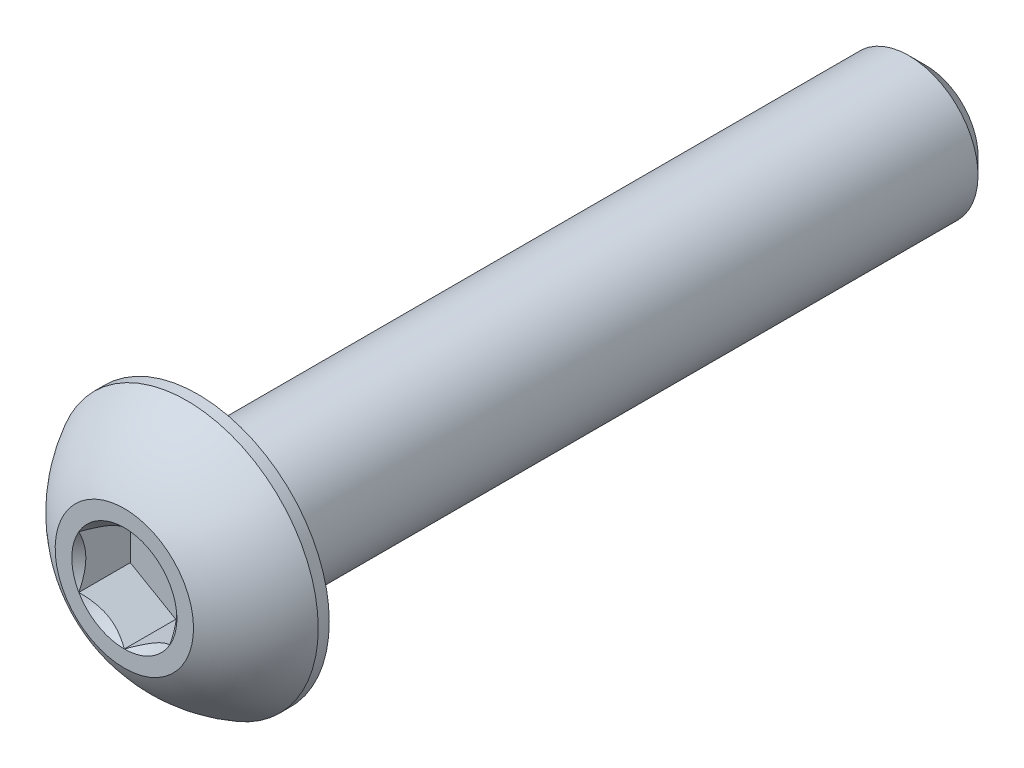
ISO-10303-21;
HEADER;
FILE_DESCRIPTION(('STEP AP214'),'2;1');
FILE_NAME('part.step','',(''),(''),'','','');
FILE_SCHEMA(('AUTOMOTIVE_DESIGN { 1 0 10303 214 1 1 1 1 }'));
ENDSEC;
DATA;
#1=APPLICATION_CONTEXT('core data for automotive mechanical design processes');
#2=APPLICATION_PROTOCOL_DEFINITION('international standard','automotive_design',2000,#1);
#3=PRODUCT_CONTEXT('',#1,'mechanical');
#4=PRODUCT('Part','Part','',(#3));
#5=PRODUCT_RELATED_PRODUCT_CATEGORY('part','',(#4));
#6=PRODUCT_DEFINITION_FORMATION('','',#4);
#7=PRODUCT_DEFINITION_CONTEXT('part definition',#1,'design');
#8=PRODUCT_DEFINITION('design','',#6,#7);
#9=PRODUCT_DEFINITION_SHAPE('','',#8);
#10=(LENGTH_UNIT() NAMED_UNIT(*) SI_UNIT(.MILLI.,.METRE.));
#11=(NAMED_UNIT(*) PLANE_ANGLE_UNIT() SI_UNIT($,.RADIAN.));
#12=(NAMED_UNIT(*) SI_UNIT($,.STERADIAN.) SOLID_ANGLE_UNIT());
#13=UNCERTAINTY_MEASURE_WITH_UNIT(LENGTH_MEASURE(1.E-05),#10,'distance_accuracy_value','');
#14=(GEOMETRIC_REPRESENTATION_CONTEXT(3) GLOBAL_UNCERTAINTY_ASSIGNED_CONTEXT((#13)) GLOBAL_UNIT_ASSIGNED_CONTEXT((#10,
#11,#12)) REPRESENTATION_CONTEXT('',''));
#15=CARTESIAN_POINT('',(0.,0.,0.));
#16=DIRECTION('',(0.,0.,1.));
#17=DIRECTION('',(1.,0.,0.));
#18=AXIS2_PLACEMENT_3D('',#15,#16,#17);
#19=CARTESIAN_POINT('',(0.,-2.413,-27.9654));
#20=DIRECTION('',(0.,0.,-1.));
#21=DIRECTION('',(0.,1.,0.));
#22=AXIS2_PLACEMENT_3D('',#19,#20,#21);
#23=PLANE('',#22);
#24=CARTESIAN_POINT('',(0.,0.,-27.9654));
#25=DIRECTION('',(0.,0.,-1.));
#26=DIRECTION('',(0.,1.,0.));
#27=AXIS2_PLACEMENT_3D('',#24,#25,#26);
#28=CIRCLE('',#27,1.81768750000001);
#29=CARTESIAN_POINT('',(0.,1.8176875,-27.9654));
#30=VERTEX_POINT('',#29);
#31=EDGE_CURVE('E42',#30,#30,#28,.T.);
#32=ORIENTED_EDGE('',*,*,#31,.T.);
#33=EDGE_LOOP('',(#32));
#34=FACE_BOUND('',#33,.T.);
#35=ADVANCED_FACE('F34',(#34),#23,.T.);
#36=CARTESIAN_POINT('',(0.,0.,-27.9654));
#37=DIRECTION('',(0.,0.,-1.));
#38=DIRECTION('',(0.,1.,0.));
#39=AXIS2_PLACEMENT_3D('',#36,#37,#38);
#40=CYLINDRICAL_SURFACE('',#39,2.413);
#41=CARTESIAN_POINT('',(0.,0.,-27.3700875));
#42=DIRECTION('',(0.,0.,-1.));
#43=DIRECTION('',(0.,1.,0.));
#44=AXIS2_PLACEMENT_3D('',#41,#42,#43);
#45=CIRCLE('',#44,2.413);
#46=CARTESIAN_POINT('',(0.,2.413,-27.3700875));
#47=VERTEX_POINT('',#46);
#48=EDGE_CURVE('E11',#47,#47,#45,.F.);
#49=ORIENTED_EDGE('',*,*,#48,.T.);
#50=EDGE_LOOP('',(#49));
#51=FACE_BOUND('',#50,.T.);
#52=CARTESIAN_POINT('',(0.,0.,-2.5654));
#53=DIRECTION('',(0.,0.,1.));
#54=DIRECTION('',(1.,0.,0.));
#55=AXIS2_PLACEMENT_3D('',#52,#53,#54);
#56=CIRCLE('',#55,2.413);
#57=CARTESIAN_POINT('',(2.413,0.,-2.5654));
#58=VERTEX_POINT('',#57);
#59=EDGE_CURVE('E168',#58,#58,#56,.F.);
#60=ORIENTED_EDGE('',*,*,#59,.T.);
#61=EDGE_LOOP('',(#60));
#62=FACE_BOUND('',#61,.T.);
#63=ADVANCED_FACE('F176',(#51,#62),#40,.T.);
#64=CARTESIAN_POINT('',(0.,0.,-27.9654));
#65=DIRECTION('',(0.,0.,1.));
#66=DIRECTION('',(0.,-1.,0.));
#67=AXIS2_PLACEMENT_3D('',#64,#65,#66);
#68=CONICAL_SURFACE('',#67,1.81768750000001,0.785398163397447);
#69=ORIENTED_EDGE('',*,*,#48,.F.);
#70=EDGE_LOOP('',(#69));
#71=FACE_BOUND('',#70,.T.);
#72=ORIENTED_EDGE('',*,*,#31,.F.);
#73=EDGE_LOOP('',(#72));
#74=FACE_BOUND('',#73,.T.);
#75=ADVANCED_FACE('F36',(#71,#74),#68,.T.);
#76=CARTESIAN_POINT('',(0.,0.,-4.5748806144438));
#77=DIRECTION('',(0.,0.,1.));
#78=DIRECTION('',(0.,-1.,0.));
#79=AXIS2_PLACEMENT_3D('',#76,#77,#78);
#80=SPHERICAL_SURFACE('',#79,5.17224338526463);
#81=CARTESIAN_POINT('',(0.,0.,0.));
#82=DIRECTION('',(0.,0.,1.));
#83=DIRECTION('',(1.,0.,0.));
#84=AXIS2_PLACEMENT_3D('',#81,#82,#83);
#85=CIRCLE('',#84,2.413);
#86=CARTESIAN_POINT('',(0.,-2.413,0.));
#87=VERTEX_POINT('',#86);
#88=EDGE_CURVE('E165',#87,#87,#85,.T.);
#89=CARTESIAN_POINT('',(0.,0.,-2.18059));
#90=DIRECTION('',(0.,0.,1.));
#91=DIRECTION('',(1.,0.,0.));
#92=AXIS2_PLACEMENT_3D('',#89,#90,#91);
#93=CIRCLE('',#92,4.5847);
#94=CARTESIAN_POINT('',(0.,-4.5847,-2.18059));
#95=VERTEX_POINT('',#94);
#96=EDGE_CURVE('E159',#95,#95,#93,.T.);
#97=CARTESIAN_POINT('',(0.,-2.413,0.));
#98=CARTESIAN_POINT('',(0.,-2.44179113663083,-0.0151857097788009));
#99=CARTESIAN_POINT('',(0.,-2.47043888331474,-0.0306432741933343));
#100=CARTESIAN_POINT('',(0.,-2.5274374690351,-0.0620964513369402));
#101=CARTESIAN_POINT('',(0.,-2.55578830807155,-0.0780920640660127));
#102=CARTESIAN_POINT('',(0.,-2.61218295074331,-0.110615676881771));
#103=CARTESIAN_POINT('',(0.,-2.64022675437863,-0.127143676968457));
#104=CARTESIAN_POINT('',(0.,-2.69599733629138,-0.160726162390165));
#105=CARTESIAN_POINT('',(0.,-2.72372411456882,-0.177780647725188));
#106=CARTESIAN_POINT('',(0.,-2.77885076121154,-0.21241002764294));
#107=CARTESIAN_POINT('',(0.,-2.80625062957682,-0.229984922225668));
#108=CARTESIAN_POINT('',(0.,-2.86071369040082,-0.265648855453746));
#109=CARTESIAN_POINT('',(0.,-2.88777688285954,-0.283737894099096));
#110=CARTESIAN_POINT('',(0.,-2.94155694533546,-0.320423667994127));
#111=CARTESIAN_POINT('',(0.,-2.96827381535265,-0.339020403243808));
#112=CARTESIAN_POINT('',(0.,-3.02135171000009,-0.37671494166065));
#113=CARTESIAN_POINT('',(0.,-3.04771273463033,-0.39581274482781));
#114=CARTESIAN_POINT('',(0.,-3.10006954235699,-0.434502611862808));
#115=CARTESIAN_POINT('',(0.,-3.12606532545341,-0.454094675730644));
#116=CARTESIAN_POINT('',(0.,-3.17768238416296,-0.493766080756604));
#117=CARTESIAN_POINT('',(0.,-3.20330365977609,-0.513845421914727));
#118=CARTESIAN_POINT('',(0.,-3.25416257105645,-0.554484224430573));
#119=CARTESIAN_POINT('',(0.,-3.27940020672367,-0.575043685788297));
#120=CARTESIAN_POINT('',(0.,-3.32948284239517,-0.616635400476975));
#121=CARTESIAN_POINT('',(0.,-3.35432784239946,-0.63766765380793));
#122=CARTESIAN_POINT('',(0.,-3.40361635097913,-0.680197455694829));
#123=CARTESIAN_POINT('',(0.,-3.42805985955453,-0.701695004250773));
#124=CARTESIAN_POINT('',(0.,-3.47653667261836,-0.745147733989217));
#125=CARTESIAN_POINT('',(0.,-3.5005699771068,-0.767102915171716));
#126=CARTESIAN_POINT('',(0.,-3.54821781555203,-0.81146308444603));
#127=CARTESIAN_POINT('',(0.,-3.57183234950881,-0.833868072537843));
#128=CARTESIAN_POINT('',(0.,-3.61863422971284,-0.879119869584105));
#129=CARTESIAN_POINT('',(0.,-3.64182157596008,-0.901966678538555));
#130=CARTESIAN_POINT('',(0.,-3.68776081583415,-0.948093973780533));
#131=CARTESIAN_POINT('',(0.,-3.71051270946098,-0.971374460068061));
#132=CARTESIAN_POINT('',(0.,-3.75557293439636,-1.01836081186645));
#133=CARTESIAN_POINT('',(0.,-3.7778812657049,-1.0420666773773));
#134=CARTESIAN_POINT('',(0.,-3.82204641440941,-1.08989533789018));
#135=CARTESIAN_POINT('',(0.,-3.84390323180538,-1.11401813289221));
#136=CARTESIAN_POINT('',(0.,-3.88715756202836,-1.16267205404467));
#137=CARTESIAN_POINT('',(0.,-3.90855507485536,-1.18720318019511));
#138=CARTESIAN_POINT('',(0.,-3.95088316899876,-1.23666501975588));
#139=CARTESIAN_POINT('',(0.,-3.97181375031515,-1.26159573316622));
#140=CARTESIAN_POINT('',(0.,-4.01320052092912,-1.31184786092909));
#141=CARTESIAN_POINT('',(0.,-4.03365671022669,-1.33716927528163));
#142=CARTESIAN_POINT('',(0.,-4.07408740538699,-1.38819377934977));
#143=CARTESIAN_POINT('',(0.,-4.09406191124973,-1.41389686906536));
#144=CARTESIAN_POINT('',(0.,-4.13352211981722,-1.46567556223513));
#145=CARTESIAN_POINT('',(0.,-4.15300782252198,-1.4917511656893));
#146=CARTESIAN_POINT('',(0.,-4.19148347927457,-1.54426559193551));
#147=CARTESIAN_POINT('',(0.,-4.2104734333224,-1.57070441472756));
#148=CARTESIAN_POINT('',(0.,-4.24795082398615,-1.6239358557723));
#149=CARTESIAN_POINT('',(0.,-4.26643826060207,-1.65072847402499));
#150=CARTESIAN_POINT('',(0.,-4.3029040266735,-1.70465795604563));
#151=CARTESIAN_POINT('',(0.,-4.32088235612901,-1.73179481981358));
#152=CARTESIAN_POINT('',(0.,-4.35632349988304,-1.78640312007115));
#153=CARTESIAN_POINT('',(0.,-4.37378631418156,-1.81387455656079));
#154=CARTESIAN_POINT('',(0.,-4.40819020238474,-1.86914221075438));
#155=CARTESIAN_POINT('',(0.,-4.42513127628939,-1.89693842845834));
#156=CARTESIAN_POINT('',(0.,-4.45848564813517,-1.95284573578717));
#157=CARTESIAN_POINT('',(0.,-4.4748989460763,-1.98095682541204));
#158=CARTESIAN_POINT('',(0.,-4.50719190474587,-2.03748386259807));
#159=CARTESIAN_POINT('',(0.,-4.5230715654743,-2.06589981015923));
#160=CARTESIAN_POINT('',(0.,-4.55429163018258,-2.12302641242262));
#161=CARTESIAN_POINT('',(0.,-4.56963203416241,-2.15173706712485));
#162=CARTESIAN_POINT('',(0.,-4.5847,-2.18059));
#163=B_SPLINE_CURVE_WITH_KNOTS('',3,(#97,#98,#99,#100,#101,#102,#103,#104,#105,#106,#107,#108,
#109,#110,#111,#112,#113,#114,#115,#116,#117,#118,#119,#120,#121,#122,#123,#124,#125,#126,#127,
#128,#129,#130,#131,#132,#133,#134,#135,#136,#137,#138,#139,#140,#141,#142,#143,#144,#145,#146,
#147,#148,#149,#150,#151,#152,#153,#154,#155,#156,#157,#158,#159,#160,#161,#162),.UNSPECIFIED.,
.F.,.F.,(4,2,2,2,2,2,2,2,2,2,2,2,2,2,2,2,2,2,2,2,2,2,2,2,2,2,2,2,2,2,2,2,4),(0.,
0.0976500604051489,0.195300120810298,0.292950181215447,0.390600241620598,0.488250302025747,
0.585900362430896,0.683550422836046,0.781200483241194,0.878850543646344,0.976500604051493,
1.07415066445664,1.17180072486179,1.26945078526694,1.36710084567209,1.46475090607724,
1.56240096648239,1.66005102688754,1.75770108729269,1.85535114769784,1.95300120810299,
2.05065126850814,2.14830132891329,2.24595138931843,2.34360144972358,2.44125151012873,
2.53890157053388,2.63655163093903,2.73420169134418,2.83185175174933,2.92950181215448,
3.02715187255963,3.12480193296478),.UNSPECIFIED.);
#164=EDGE_CURVE('BSEAM175',#87,#95,#163,.T.);
#165=ORIENTED_EDGE('',*,*,#88,.F.);
#166=ORIENTED_EDGE('',*,*,#96,.T.);
#167=ORIENTED_EDGE('',*,*,#164,.T.);
#168=ORIENTED_EDGE('',*,*,#164,.F.);
#169=EDGE_LOOP('',(#165,#167,#166,#168));
#170=FACE_BOUND('',#169,.T.);
#171=ADVANCED_FACE('F175',(#170),#80,.T.);
#172=CARTESIAN_POINT('',(0.,-2.413,0.));
#173=DIRECTION('',(0.,0.,-1.));
#174=DIRECTION('',(-1.,0.,0.));
#175=AXIS2_PLACEMENT_3D('',#172,#173,#174);
#176=PLANE('',#175);
#177=CARTESIAN_POINT('',(0.,0.,0.));
#178=DIRECTION('',(0.,0.,1.));
#179=DIRECTION('',(1.,0.,0.));
#180=AXIS2_PLACEMENT_3D('',#177,#178,#179);
#181=CIRCLE('',#180,1.83308710467706);
#182=CARTESIAN_POINT('',(-1.5875,0.91654355233853,0.));
#183=VERTEX_POINT('',#182);
#184=CARTESIAN_POINT('',(-1.5875,-0.916543552338531,0.));
#185=VERTEX_POINT('',#184);
#186=EDGE_CURVE('E55',#183,#185,#181,.T.);
#187=ORIENTED_EDGE('',*,*,#186,.F.);
#188=CARTESIAN_POINT('',(0.,1.83308710467706,0.));
#189=VERTEX_POINT('',#188);
#190=EDGE_CURVE('E129',#189,#183,#181,.T.);
#191=ORIENTED_EDGE('',*,*,#190,.F.);
#192=CARTESIAN_POINT('',(1.5875,0.916543552338531,0.));
#193=VERTEX_POINT('',#192);
#194=EDGE_CURVE('E106',#193,#189,#181,.T.);
#195=ORIENTED_EDGE('',*,*,#194,.F.);
#196=CARTESIAN_POINT('',(1.5875,-0.916543552338531,0.));
#197=VERTEX_POINT('',#196);
#198=EDGE_CURVE('E95',#197,#193,#181,.T.);
#199=ORIENTED_EDGE('',*,*,#198,.F.);
#200=CARTESIAN_POINT('',(0.,-1.83308710467706,0.));
#201=VERTEX_POINT('',#200);
#202=EDGE_CURVE('E87',#201,#197,#181,.T.);
#203=ORIENTED_EDGE('',*,*,#202,.F.);
#204=EDGE_CURVE('E48',#185,#201,#181,.T.);
#205=ORIENTED_EDGE('',*,*,#204,.F.);
#206=EDGE_LOOP('',(#187,#191,#195,#199,#203,#205));
#207=FACE_BOUND('',#206,.T.);
#208=ORIENTED_EDGE('',*,*,#88,.T.);
#209=EDGE_LOOP('',(#208));
#210=FACE_BOUND('',#209,.T.);
#211=ADVANCED_FACE('F126',(#207,#210),#176,.F.);
#212=CARTESIAN_POINT('',(0.,-4.5847,-2.5654));
#213=DIRECTION('',(0.,0.,1.));
#214=DIRECTION('',(1.,0.,0.));
#215=AXIS2_PLACEMENT_3D('',#212,#213,#214);
#216=PLANE('',#215);
#217=ORIENTED_EDGE('',*,*,#59,.F.);
#218=EDGE_LOOP('',(#217));
#219=FACE_BOUND('',#218,.T.);
#220=CARTESIAN_POINT('',(0.,0.,-2.5654));
#221=DIRECTION('',(0.,0.,1.));
#222=DIRECTION('',(1.,0.,0.));
#223=AXIS2_PLACEMENT_3D('',#220,#221,#222);
#224=CIRCLE('',#223,4.5847);
#225=CARTESIAN_POINT('',(4.5847,0.,-2.5654));
#226=VERTEX_POINT('',#225);
#227=EDGE_CURVE('E162',#226,#226,#224,.T.);
#228=ORIENTED_EDGE('',*,*,#227,.F.);
#229=EDGE_LOOP('',(#228));
#230=FACE_BOUND('',#229,.T.);
#231=ADVANCED_FACE('F193',(#219,#230),#216,.F.);
#232=CARTESIAN_POINT('',(0.,0.,0.));
#233=DIRECTION('',(0.,0.,1.));
#234=DIRECTION('',(1.,0.,0.));
#235=AXIS2_PLACEMENT_3D('',#232,#233,#234);
#236=CYLINDRICAL_SURFACE('',#235,4.5847);
#237=ORIENTED_EDGE('',*,*,#96,.F.);
#238=EDGE_LOOP('',(#237));
#239=FACE_BOUND('',#238,.T.);
#240=ORIENTED_EDGE('',*,*,#227,.T.);
#241=EDGE_LOOP('',(#240));
#242=FACE_BOUND('',#241,.T.);
#243=ADVANCED_FACE('F196',(#239,#242),#236,.T.);
#244=CARTESIAN_POINT('',(0.,0.,0.));
#245=DIRECTION('',(0.,0.,1.));
#246=DIRECTION('',(1.,0.,0.));
#247=AXIS2_PLACEMENT_3D('',#244,#245,#246);
#248=CONICAL_SURFACE('',#247,1.83308710467706,0.78539816339745);
#249=ORIENTED_EDGE('',*,*,#198,.T.);
#250=CARTESIAN_POINT('',(1.5875,-1.83163614232865,0.590762562254565));
#251=CARTESIAN_POINT('',(1.5875,-1.78705354844902,0.55707785480324));
#252=CARTESIAN_POINT('',(1.5875,-1.74222294150555,0.523722329968627));
#253=CARTESIAN_POINT('',(1.5875,-1.65196486784504,0.457805675888285));
#254=CARTESIAN_POINT('',(1.5875,-1.60653725449665,0.425244747634468));
#255=CARTESIAN_POINT('',(1.5875,-1.46854281940082,0.328493449461236));
#256=CARTESIAN_POINT('',(1.5875,-1.37494211623386,0.265753264612858));
#257=CARTESIAN_POINT('',(1.5875,-1.17864136265695,0.142553151294645));
#258=CARTESIAN_POINT('',(1.5875,-1.07572731596385,0.0824303289226488));
#259=CARTESIAN_POINT('',(1.5875,-0.864754189558117,-0.0275706334490079));
#260=CARTESIAN_POINT('',(1.5875,-0.756714033301438,-0.0774833149376714));
#261=CARTESIAN_POINT('',(1.5875,-0.594580029688666,-0.138547963751185));
#262=CARTESIAN_POINT('',(1.5875,-0.542894373932897,-0.156067797502568));
#263=CARTESIAN_POINT('',(1.5875,-0.43827206291756,-0.186958420156953));
#264=CARTESIAN_POINT('',(1.5875,-0.3853353220534,-0.200328924255393));
#265=CARTESIAN_POINT('',(1.5875,-0.27941340073437,-0.222002681044568));
#266=CARTESIAN_POINT('',(1.5875,-0.226446313904206,-0.230392976800141));
#267=CARTESIAN_POINT('',(1.5875,-0.119941637592404,-0.241941911012322));
#268=CARTESIAN_POINT('',(1.5875,-0.0664041486263234,-0.245101456366562));
#269=CARTESIAN_POINT('',(1.5875,0.0387581192420279,-0.245952982965122));
#270=CARTESIAN_POINT('',(1.5875,0.090381381554216,-0.243840334608509));
#271=CARTESIAN_POINT('',(1.5875,0.19318730201683,-0.234695846678065));
#272=CARTESIAN_POINT('',(1.5875,0.244369916988517,-0.227663530460197));
#273=CARTESIAN_POINT('',(1.5875,0.346790527788956,-0.208944949355169));
#274=CARTESIAN_POINT('',(1.5875,0.398013804172139,-0.197179358640977));
#275=CARTESIAN_POINT('',(1.5875,0.499340680307276,-0.169620657149212));
#276=CARTESIAN_POINT('',(1.5875,0.549444372105894,-0.153827878801824));
#277=CARTESIAN_POINT('',(1.5875,0.707022639586407,-0.0982133790717417));
#278=CARTESIAN_POINT('',(1.5875,0.812258737570578,-0.0520647672653368));
#279=CARTESIAN_POINT('',(1.5875,1.01778869013701,0.0505458403808823));
#280=CARTESIAN_POINT('',(1.5875,1.11806310933257,0.107044855107553));
#281=CARTESIAN_POINT('',(1.5875,1.30970442577157,0.223612502972616));
#282=CARTESIAN_POINT('',(1.5875,1.40126637149297,0.283364441978613));
#283=CARTESIAN_POINT('',(1.5875,1.53616443073864,0.37573700869171));
#284=CARTESIAN_POINT('',(1.5875,1.58054835823549,0.406854014274728));
#285=CARTESIAN_POINT('',(1.5875,1.66870952512132,0.469911550181166));
#286=CARTESIAN_POINT('',(1.5875,1.71248692801697,0.501851851647461));
#287=CARTESIAN_POINT('',(1.5875,1.75601179240957,0.534133557847131));
#288=B_SPLINE_CURVE_WITH_KNOTS('',3,(#250,#251,#252,#253,#254,#255,#256,#257,#258,#259,#260,
#261,#262,#263,#264,#265,#266,#267,#268,#269,#270,#271,#272,#273,#274,#275,#276,#277,#278,#279,
#280,#281,#282,#283,#284,#285,#286,#287),.UNSPECIFIED.,.F.,.F.,(4,2,2,2,2,2,2,2,2,2,2,2,2,2,2,2,
2,2,4),(0.,0.167627505127548,0.33529698084648,0.673194674702938,1.0304700708717,
1.38651603079307,1.55010049300858,1.71369618096554,1.87434127467533,2.034958513124,
2.18971280484453,2.34448209207484,2.50196108385089,2.65942708049529,3.00314617711216,
3.34811949873714,3.6759579216973,3.83856722085481,4.00113179576279),.UNSPECIFIED.);
#289=EDGE_CURVE('E100',#197,#193,#288,.T.);
#290=ORIENTED_EDGE('',*,*,#289,.F.);
#291=EDGE_LOOP('',(#249,#290));
#292=FACE_BOUND('',#291,.T.);
#293=ADVANCED_FACE('F101',(#292),#248,.F.);
#294=ORIENTED_EDGE('',*,*,#194,.T.);
#295=CARTESIAN_POINT('',(1.5877,0.916428082284693,0.000115480963706964));
#296=CARTESIAN_POINT('',(1.53312479190086,0.947937093371809,-0.0313691916294028));
#297=CARTESIAN_POINT('',(1.47763696320971,0.979973006203395,-0.0610049539864698));
#298=CARTESIAN_POINT('',(1.36449087915364,1.04529792829092,-0.115267739979175));
#299=CARTESIAN_POINT('',(1.30682185887062,1.07859315267522,-0.139864564866823));
#300=CARTESIAN_POINT('',(1.1905349781269,1.14573141457583,-0.181999635727418));
#301=CARTESIAN_POINT('',(1.13194674474407,1.17955734689075,-0.199643807270178));
#302=CARTESIAN_POINT('',(1.01348022674557,1.24795402294714,-0.226828529915031));
#303=CARTESIAN_POINT('',(0.953605562983896,1.28252267618758,-0.236389379304923));
#304=CARTESIAN_POINT('',(0.850418771876558,1.34209759781022,-0.245015586895992));
#305=CARTESIAN_POINT('',(0.807240015952288,1.36702686416637,-0.246292807190424));
#306=CARTESIAN_POINT('',(0.720953038535399,1.41684467380557,-0.244142944185295));
#307=CARTESIAN_POINT('',(0.677844847078612,1.44173319974742,-0.240714211450657));
#308=CARTESIAN_POINT('',(0.592046335002031,1.49126899379091,-0.229349005566657));
#309=CARTESIAN_POINT('',(0.549356408925407,1.51591603410293,-0.221408628198358));
#310=CARTESIAN_POINT('',(0.464693063478359,1.56479643938728,-0.201451585548899));
#311=CARTESIAN_POINT('',(0.422719959755075,1.58902962212064,-0.189433170791309));
#312=CARTESIAN_POINT('',(0.315211458113566,1.65109968448354,-0.153753102752754));
#313=CARTESIAN_POINT('',(0.2503427717089,1.68855163804125,-0.127401427696863));
#314=CARTESIAN_POINT('',(0.154961599380924,1.74361998356043,-0.082916463148298));
#315=CARTESIAN_POINT('',(0.123530699536157,1.76176662204668,-0.0672871421988686));
#316=CARTESIAN_POINT('',(0.0612469855696368,1.79772614107138,-0.0346015121388987));
#317=CARTESIAN_POINT('',(0.0303939039605763,1.8155391760437,-0.0175458843430302));
#318=CARTESIAN_POINT('',(-0.000200000000000412,1.8332025747309,0.000115480963706783));
#319=B_SPLINE_CURVE_WITH_KNOTS('',3,(#295,#296,#297,#298,#299,#300,#301,#302,#303,#304,#305,
#306,#307,#308,#309,#310,#311,#312,#313,#314,#315,#316,#317,#318),.UNSPECIFIED.,.F.,.F.,(4,2,2,
2,2,2,2,2,2,2,2,4),(0.,0.211482650810816,0.424197870807275,0.633533884524815,0.842342653263348,
0.99175555372714,1.14122083674204,1.29081565918877,1.44047473906437,1.6781878086972,
1.79671410024894,1.91518409436631),.UNSPECIFIED.);
#320=EDGE_CURVE('E105',#193,#189,#319,.T.);
#321=ORIENTED_EDGE('',*,*,#320,.F.);
#322=EDGE_LOOP('',(#294,#321));
#323=FACE_BOUND('',#322,.T.);
#324=ADVANCED_FACE('F281',(#323),#248,.F.);
#325=ORIENTED_EDGE('',*,*,#190,.T.);
#326=CARTESIAN_POINT('',(0.000199999999999602,1.8332025747309,0.000115480963706835));
#327=CARTESIAN_POINT('',(-0.0543752080991368,1.80169356364378,-0.031369191629403));
#328=CARTESIAN_POINT('',(-0.10986303679029,1.7696576508122,-0.06100495398647));
#329=CARTESIAN_POINT('',(-0.223009120846359,1.70433272872467,-0.115267739979175));
#330=CARTESIAN_POINT('',(-0.280678141129381,1.67103750434037,-0.139864564866824));
#331=CARTESIAN_POINT('',(-0.396965021873103,1.60389924243976,-0.181999635727418));
#332=CARTESIAN_POINT('',(-0.455553255255931,1.57007331012484,-0.199643807270178));
#333=CARTESIAN_POINT('',(-0.574019773254431,1.50167663406845,-0.226828529915031));
#334=CARTESIAN_POINT('',(-0.633894437016105,1.46710798082801,-0.236389379304923));
#335=CARTESIAN_POINT('',(-0.737081228123443,1.40753305920537,-0.245015586895992));
#336=CARTESIAN_POINT('',(-0.780259984047713,1.38260379284922,-0.246292807190424));
#337=CARTESIAN_POINT('',(-0.866546961464602,1.33278598321002,-0.244142944185295));
#338=CARTESIAN_POINT('',(-0.909655152921388,1.30789745726817,-0.240714211450657));
#339=CARTESIAN_POINT('',(-0.99545366499797,1.25836166322468,-0.229349005566657));
#340=CARTESIAN_POINT('',(-1.03814359107459,1.23371462291266,-0.221408628198358));
#341=CARTESIAN_POINT('',(-1.12280693652164,1.18483421762831,-0.201451585548899));
#342=CARTESIAN_POINT('',(-1.16478004024493,1.16060103489495,-0.189433170791309));
#343=CARTESIAN_POINT('',(-1.27228854188643,1.09853097253205,-0.153753102752754));
#344=CARTESIAN_POINT('',(-1.3371572282911,1.06107901897434,-0.127401427696863));
#345=CARTESIAN_POINT('',(-1.43253840061908,1.00601067345516,-0.082916463148298));
#346=CARTESIAN_POINT('',(-1.46396930046384,0.987864034968913,-0.0672871421988685));
#347=CARTESIAN_POINT('',(-1.52625301443036,0.951904515944214,-0.0346015121388985));
#348=CARTESIAN_POINT('',(-1.55710609603942,0.934091480971893,-0.0175458843430301));
#349=CARTESIAN_POINT('',(-1.5877,0.916428082284692,0.000115480963706555));
#350=B_SPLINE_CURVE_WITH_KNOTS('',3,(#326,#327,#328,#329,#330,#331,#332,#333,#334,#335,#336,
#337,#338,#339,#340,#341,#342,#343,#344,#345,#346,#347,#348,#349),.UNSPECIFIED.,.F.,.F.,(4,2,2,
2,2,2,2,2,2,2,2,4),(0.,0.211482650810816,0.424197870807276,0.633533884524816,0.842342653263348,
0.991755553727141,1.14122083674205,1.29081565918877,1.44047473906438,1.6781878086972,
1.79671410024894,1.91518409436631),.UNSPECIFIED.);
#351=EDGE_CURVE('E136',#189,#183,#350,.T.);
#352=ORIENTED_EDGE('',*,*,#351,.F.);
#353=EDGE_LOOP('',(#325,#352));
#354=FACE_BOUND('',#353,.T.);
#355=ADVANCED_FACE('F134',(#354),#248,.F.);
#356=ORIENTED_EDGE('',*,*,#186,.T.);
#357=CARTESIAN_POINT('',(-1.5875,-1.83163614232865,0.590762562254564));
#358=CARTESIAN_POINT('',(-1.5875,-1.78705354844902,0.557077854803239));
#359=CARTESIAN_POINT('',(-1.5875,-1.74222294150555,0.523722329968626));
#360=CARTESIAN_POINT('',(-1.5875,-1.65196486784504,0.457805675888285));
#361=CARTESIAN_POINT('',(-1.5875,-1.60653725449665,0.425244747634468));
#362=CARTESIAN_POINT('',(-1.5875,-1.46854281940082,0.328493449461235));
#363=CARTESIAN_POINT('',(-1.5875,-1.37494211623386,0.265753264612857));
#364=CARTESIAN_POINT('',(-1.5875,-1.17864136265695,0.142553151294644));
#365=CARTESIAN_POINT('',(-1.5875,-1.07572731596385,0.0824303289226486));
#366=CARTESIAN_POINT('',(-1.5875,-0.864754189558117,-0.0275706334490081));
#367=CARTESIAN_POINT('',(-1.5875,-0.756714033301438,-0.0774833149376718));
#368=CARTESIAN_POINT('',(-1.5875,-0.594580029688666,-0.138547963751185));
#369=CARTESIAN_POINT('',(-1.5875,-0.542894373932898,-0.156067797502568));
#370=CARTESIAN_POINT('',(-1.5875,-0.438272062917561,-0.186958420156953));
#371=CARTESIAN_POINT('',(-1.5875,-0.385335322053401,-0.200328924255393));
#372=CARTESIAN_POINT('',(-1.5875,-0.27941340073437,-0.222002681044568));
#373=CARTESIAN_POINT('',(-1.5875,-0.226446313904207,-0.230392976800141));
#374=CARTESIAN_POINT('',(-1.5875,-0.119941637592405,-0.241941911012322));
#375=CARTESIAN_POINT('',(-1.5875,-0.0664041486263238,-0.245101456366562));
#376=CARTESIAN_POINT('',(-1.5875,0.0387581192420274,-0.245952982965122));
#377=CARTESIAN_POINT('',(-1.5875,0.0903813815542156,-0.243840334608509));
#378=CARTESIAN_POINT('',(-1.5875,0.193187302016829,-0.234695846678065));
#379=CARTESIAN_POINT('',(-1.5875,0.244369916988516,-0.227663530460197));
#380=CARTESIAN_POINT('',(-1.5875,0.346790527788956,-0.208944949355169));
#381=CARTESIAN_POINT('',(-1.5875,0.398013804172139,-0.197179358640977));
#382=CARTESIAN_POINT('',(-1.5875,0.499340680307276,-0.169620657149213));
#383=CARTESIAN_POINT('',(-1.5875,0.549444372105893,-0.153827878801824));
#384=CARTESIAN_POINT('',(-1.5875,0.707022639586407,-0.0982133790717423));
#385=CARTESIAN_POINT('',(-1.5875,0.812258737570577,-0.0520647672653372));
#386=CARTESIAN_POINT('',(-1.5875,1.01778869013701,0.050545840380882));
#387=CARTESIAN_POINT('',(-1.5875,1.11806310933256,0.107044855107552));
#388=CARTESIAN_POINT('',(-1.5875,1.30970442577157,0.223612502972616));
#389=CARTESIAN_POINT('',(-1.5875,1.40126637149297,0.283364441978612));
#390=CARTESIAN_POINT('',(-1.5875,1.53616443073864,0.375737008691709));
#391=CARTESIAN_POINT('',(-1.5875,1.58054835823549,0.406854014274727));
#392=CARTESIAN_POINT('',(-1.5875,1.66870952512132,0.469911550181165));
#393=CARTESIAN_POINT('',(-1.5875,1.71248692801697,0.50185185164746));
#394=CARTESIAN_POINT('',(-1.5875,1.75601179240957,0.53413355784713));
#395=B_SPLINE_CURVE_WITH_KNOTS('',3,(#357,#358,#359,#360,#361,#362,#363,#364,#365,#366,#367,
#368,#369,#370,#371,#372,#373,#374,#375,#376,#377,#378,#379,#380,#381,#382,#383,#384,#385,#386,
#387,#388,#389,#390,#391,#392,#393,#394),.UNSPECIFIED.,.F.,.F.,(4,2,2,2,2,2,2,2,2,2,2,2,2,2,2,2,
2,2,4),(0.,0.167627505127548,0.335296980846479,0.673194674702938,1.0304700708717,
1.38651603079307,1.55010049300858,1.71369618096554,1.87434127467533,2.034958513124,
2.18971280484453,2.34448209207484,2.50196108385089,2.65942708049529,3.00314617711216,
3.34811949873714,3.67595792169729,3.83856722085481,4.00113179576279),.UNSPECIFIED.);
#396=EDGE_CURVE('E140',#183,#185,#395,.F.);
#397=ORIENTED_EDGE('',*,*,#396,.F.);
#398=EDGE_LOOP('',(#356,#397));
#399=FACE_BOUND('',#398,.T.);
#400=ADVANCED_FACE('F275',(#399),#248,.F.);
#401=ORIENTED_EDGE('',*,*,#204,.T.);
#402=CARTESIAN_POINT('',(-1.5877,-0.916428082284693,0.000115480963706531));
#403=CARTESIAN_POINT('',(-1.53312479190086,-0.947937093371809,-0.0313691916294031));
#404=CARTESIAN_POINT('',(-1.47763696320971,-0.979973006203394,-0.06100495398647));
#405=CARTESIAN_POINT('',(-1.36449087915364,-1.04529792829092,-0.115267739979175));
#406=CARTESIAN_POINT('',(-1.30682185887062,-1.07859315267522,-0.139864564866824));
#407=CARTESIAN_POINT('',(-1.1905349781269,-1.14573141457583,-0.181999635727418));
#408=CARTESIAN_POINT('',(-1.13194674474407,-1.17955734689075,-0.199643807270178));
#409=CARTESIAN_POINT('',(-1.01348022674557,-1.24795402294714,-0.226828529915031));
#410=CARTESIAN_POINT('',(-0.953605562983895,-1.28252267618758,-0.236389379304923));
#411=CARTESIAN_POINT('',(-0.850418771876558,-1.34209759781022,-0.245015586895992));
#412=CARTESIAN_POINT('',(-0.807240015952288,-1.36702686416637,-0.246292807190424));
#413=CARTESIAN_POINT('',(-0.720953038535399,-1.41684467380557,-0.244142944185295));
#414=CARTESIAN_POINT('',(-0.677844847078612,-1.44173319974742,-0.240714211450657));
#415=CARTESIAN_POINT('',(-0.592046335002031,-1.49126899379091,-0.229349005566657));
#416=CARTESIAN_POINT('',(-0.549356408925407,-1.51591603410293,-0.221408628198358));
#417=CARTESIAN_POINT('',(-0.464693063478359,-1.56479643938728,-0.201451585548899));
#418=CARTESIAN_POINT('',(-0.422719959755075,-1.58902962212064,-0.189433170791309));
#419=CARTESIAN_POINT('',(-0.315211458113566,-1.65109968448354,-0.153753102752754));
#420=CARTESIAN_POINT('',(-0.2503427717089,-1.68855163804125,-0.127401427696864));
#421=CARTESIAN_POINT('',(-0.154961599380924,-1.74361998356043,-0.082916463148298));
#422=CARTESIAN_POINT('',(-0.123530699536156,-1.76176662204668,-0.0672871421988684));
#423=CARTESIAN_POINT('',(-0.0612469855696366,-1.79772614107138,-0.0346015121388983));
#424=CARTESIAN_POINT('',(-0.030393903960576,-1.8155391760437,-0.0175458843430298));
#425=CARTESIAN_POINT('',(0.000200000000000753,-1.8332025747309,0.000115480963706965));
#426=B_SPLINE_CURVE_WITH_KNOTS('',3,(#402,#403,#404,#405,#406,#407,#408,#409,#410,#411,#412,
#413,#414,#415,#416,#417,#418,#419,#420,#421,#422,#423,#424,#425),.UNSPECIFIED.,.F.,.F.,(4,2,2,
2,2,2,2,2,2,2,2,4),(0.,0.211482650810816,0.424197870807275,0.633533884524815,0.842342653263347,
0.99175555372714,1.14122083674204,1.29081565918877,1.44047473906437,1.6781878086972,
1.79671410024894,1.91518409436631),.UNSPECIFIED.);
#427=EDGE_CURVE('E116',#185,#201,#426,.T.);
#428=ORIENTED_EDGE('',*,*,#427,.F.);
#429=EDGE_LOOP('',(#401,#428));
#430=FACE_BOUND('',#429,.T.);
#431=ADVANCED_FACE('F223',(#430),#248,.F.);
#432=ORIENTED_EDGE('',*,*,#202,.T.);
#433=CARTESIAN_POINT('',(-0.000199999999999123,-1.8332025747309,0.000115480963707269));
#434=CARTESIAN_POINT('',(0.0543752080991372,-1.80169356364378,-0.0313691916294027));
#435=CARTESIAN_POINT('',(0.109863036790291,-1.7696576508122,-0.0610049539864697));
#436=CARTESIAN_POINT('',(0.22300912084636,-1.70433272872467,-0.115267739979174));
#437=CARTESIAN_POINT('',(0.280678141129382,-1.67103750434037,-0.139864564866823));
#438=CARTESIAN_POINT('',(0.396965021873104,-1.60389924243976,-0.181999635727418));
#439=CARTESIAN_POINT('',(0.455553255255932,-1.57007331012484,-0.199643807270178));
#440=CARTESIAN_POINT('',(0.574019773254432,-1.50167663406845,-0.226828529915031));
#441=CARTESIAN_POINT('',(0.633894437016106,-1.46710798082801,-0.236389379304922));
#442=CARTESIAN_POINT('',(0.737081228123443,-1.40753305920537,-0.245015586895992));
#443=CARTESIAN_POINT('',(0.780259984047713,-1.38260379284922,-0.246292807190423));
#444=CARTESIAN_POINT('',(0.866546961464602,-1.33278598321002,-0.244142944185295));
#445=CARTESIAN_POINT('',(0.909655152921389,-1.30789745726817,-0.240714211450656));
#446=CARTESIAN_POINT('',(0.99545366499797,-1.25836166322468,-0.229349005566656));
#447=CARTESIAN_POINT('',(1.03814359107459,-1.23371462291266,-0.221408628198358));
#448=CARTESIAN_POINT('',(1.12280693652164,-1.18483421762831,-0.201451585548898));
#449=CARTESIAN_POINT('',(1.16478004024493,-1.16060103489495,-0.189433170791309));
#450=CARTESIAN_POINT('',(1.27228854188643,-1.09853097253205,-0.153753102752754));
#451=CARTESIAN_POINT('',(1.3371572282911,-1.06107901897434,-0.127401427696863));
#452=CARTESIAN_POINT('',(1.43253840061908,-1.00601067345516,-0.0829164631482976));
#453=CARTESIAN_POINT('',(1.46396930046384,-0.987864034968914,-0.0672871421988682));
#454=CARTESIAN_POINT('',(1.52625301443036,-0.951904515944214,-0.0346015121388983));
#455=CARTESIAN_POINT('',(1.55710609603942,-0.934091480971893,-0.0175458843430299));
#456=CARTESIAN_POINT('',(1.5877,-0.916428082284693,0.000115480963706771));
#457=B_SPLINE_CURVE_WITH_KNOTS('',3,(#433,#434,#435,#436,#437,#438,#439,#440,#441,#442,#443,
#444,#445,#446,#447,#448,#449,#450,#451,#452,#453,#454,#455,#456),.UNSPECIFIED.,.F.,.F.,(4,2,2,
2,2,2,2,2,2,2,2,4),(0.,0.211482650810816,0.424197870807276,0.633533884524815,0.842342653263348,
0.991755553727141,1.14122083674205,1.29081565918877,1.44047473906438,1.6781878086972,
1.79671410024894,1.91518409436631),.UNSPECIFIED.);
#458=EDGE_CURVE('E91',#201,#197,#457,.T.);
#459=ORIENTED_EDGE('',*,*,#458,.F.);
#460=EDGE_LOOP('',(#432,#459));
#461=FACE_BOUND('',#460,.T.);
#462=ADVANCED_FACE('F89',(#461),#248,.F.);
#463=CARTESIAN_POINT('',(1.5875,-0.916543552338531,-1.79578));
#464=DIRECTION('',(0.,0.,1.));
#465=DIRECTION('',(1.,0.,0.));
#466=AXIS2_PLACEMENT_3D('',#463,#464,#465);
#467=PLANE('',#466);
#468=DIRECTION('',(0.866025403784438,0.5,0.));
#469=VECTOR('',#468,1.);
#470=CARTESIAN_POINT('',(0.,-1.83308710467706,-1.79578));
#471=LINE('',#470,#469);
#472=CARTESIAN_POINT('',(0.,-1.83308710467706,-1.79578));
#473=VERTEX_POINT('',#472);
#474=CARTESIAN_POINT('',(1.5875,-0.916543552338531,-1.79578));
#475=VERTEX_POINT('',#474);
#476=EDGE_CURVE('E115',#473,#475,#471,.T.);
#477=ORIENTED_EDGE('',*,*,#476,.T.);
#478=DIRECTION('',(0.,1.,0.));
#479=VECTOR('',#478,1.);
#480=CARTESIAN_POINT('',(1.5875,-0.916543552338531,-1.79578));
#481=LINE('',#480,#479);
#482=CARTESIAN_POINT('',(1.5875,0.916543552338531,-1.79578));
#483=VERTEX_POINT('',#482);
#484=EDGE_CURVE('E120',#475,#483,#481,.T.);
#485=ORIENTED_EDGE('',*,*,#484,.T.);
#486=DIRECTION('',(-0.866025403784439,0.5,0.));
#487=VECTOR('',#486,1.);
#488=CARTESIAN_POINT('',(1.5875,0.916543552338531,-1.79578));
#489=LINE('',#488,#487);
#490=CARTESIAN_POINT('',(0.,1.83308710467706,-1.79578));
#491=VERTEX_POINT('',#490);
#492=EDGE_CURVE('E265',#483,#491,#489,.T.);
#493=ORIENTED_EDGE('',*,*,#492,.T.);
#494=DIRECTION('',(-0.866025403784438,-0.5,0.));
#495=VECTOR('',#494,1.);
#496=CARTESIAN_POINT('',(0.,1.83308710467706,-1.79578));
#497=LINE('',#496,#495);
#498=CARTESIAN_POINT('',(-1.5875,0.91654355233853,-1.79578));
#499=VERTEX_POINT('',#498);
#500=EDGE_CURVE('E150',#491,#499,#497,.T.);
#501=ORIENTED_EDGE('',*,*,#500,.T.);
#502=DIRECTION('',(0.,-1.,0.));
#503=VECTOR('',#502,1.);
#504=CARTESIAN_POINT('',(-1.5875,0.91654355233853,-1.79578));
#505=LINE('',#504,#503);
#506=CARTESIAN_POINT('',(-1.5875,-0.916543552338531,-1.79578));
#507=VERTEX_POINT('',#506);
#508=EDGE_CURVE('E269',#499,#507,#505,.T.);
#509=ORIENTED_EDGE('',*,*,#508,.T.);
#510=DIRECTION('',(0.866025403784439,-0.5,0.));
#511=VECTOR('',#510,1.);
#512=CARTESIAN_POINT('',(-1.5875,-0.916543552338531,-1.79578));
#513=LINE('',#512,#511);
#514=EDGE_CURVE('E123',#507,#473,#513,.T.);
#515=ORIENTED_EDGE('',*,*,#514,.T.);
#516=EDGE_LOOP('',(#477,#485,#493,#501,#509,#515));
#517=FACE_BOUND('',#516,.T.);
#518=ADVANCED_FACE('F222',(#517),#467,.T.);
#519=CARTESIAN_POINT('',(1.5875,-0.916543552338531,-1.79578));
#520=DIRECTION('',(1.,0.,0.));
#521=DIRECTION('',(0.,0.,-1.));
#522=AXIS2_PLACEMENT_3D('',#519,#520,#521);
#523=PLANE('',#522);
#524=DIRECTION('',(0.,0.,1.));
#525=VECTOR('',#524,1.);
#526=CARTESIAN_POINT('',(1.5875,-0.916543552338531,-1.79578));
#527=LINE('',#526,#525);
#528=EDGE_CURVE('E112',#475,#197,#527,.T.);
#529=ORIENTED_EDGE('',*,*,#528,.T.);
#530=ORIENTED_EDGE('',*,*,#289,.T.);
#531=DIRECTION('',(0.,0.,1.));
#532=VECTOR('',#531,1.);
#533=CARTESIAN_POINT('',(1.5875,0.916543552338531,-1.79578));
#534=LINE('',#533,#532);
#535=EDGE_CURVE('E122',#483,#193,#534,.T.);
#536=ORIENTED_EDGE('',*,*,#535,.F.);
#537=ORIENTED_EDGE('',*,*,#484,.F.);
#538=EDGE_LOOP('',(#529,#530,#536,#537));
#539=FACE_BOUND('',#538,.T.);
#540=ADVANCED_FACE('F118',(#539),#523,.F.);
#541=CARTESIAN_POINT('',(1.5875,0.916543552338531,-1.79578));
#542=DIRECTION('',(0.5,0.866025403784439,0.));
#543=DIRECTION('',(-0.866025403784439,0.5,0.));
#544=AXIS2_PLACEMENT_3D('',#541,#542,#543);
#545=PLANE('',#544);
#546=ORIENTED_EDGE('',*,*,#535,.T.);
#547=ORIENTED_EDGE('',*,*,#320,.T.);
#548=DIRECTION('',(0.,0.,1.));
#549=VECTOR('',#548,1.);
#550=CARTESIAN_POINT('',(0.,1.83308710467706,-1.79578));
#551=LINE('',#550,#549);
#552=EDGE_CURVE('E145',#491,#189,#551,.T.);
#553=ORIENTED_EDGE('',*,*,#552,.F.);
#554=ORIENTED_EDGE('',*,*,#492,.F.);
#555=EDGE_LOOP('',(#546,#547,#553,#554));
#556=FACE_BOUND('',#555,.T.);
#557=ADVANCED_FACE('F143',(#556),#545,.F.);
#558=CARTESIAN_POINT('',(0.,1.83308710467706,-1.79578));
#559=DIRECTION('',(-0.5,0.866025403784438,0.));
#560=DIRECTION('',(-0.866025403784439,-0.5,0.));
#561=AXIS2_PLACEMENT_3D('',#558,#559,#560);
#562=PLANE('',#561);
#563=ORIENTED_EDGE('',*,*,#552,.T.);
#564=ORIENTED_EDGE('',*,*,#351,.T.);
#565=DIRECTION('',(0.,0.,1.));
#566=VECTOR('',#565,1.);
#567=CARTESIAN_POINT('',(-1.5875,0.91654355233853,-1.79578));
#568=LINE('',#567,#566);
#569=EDGE_CURVE('E152',#499,#183,#568,.T.);
#570=ORIENTED_EDGE('',*,*,#569,.F.);
#571=ORIENTED_EDGE('',*,*,#500,.F.);
#572=EDGE_LOOP('',(#563,#564,#570,#571));
#573=FACE_BOUND('',#572,.T.);
#574=ADVANCED_FACE('F148',(#573),#562,.F.);
#575=CARTESIAN_POINT('',(-1.5875,0.91654355233853,-1.79578));
#576=DIRECTION('',(-1.,0.,0.));
#577=DIRECTION('',(0.,-1.,0.));
#578=AXIS2_PLACEMENT_3D('',#575,#576,#577);
#579=PLANE('',#578);
#580=ORIENTED_EDGE('',*,*,#569,.T.);
#581=ORIENTED_EDGE('',*,*,#396,.T.);
#582=DIRECTION('',(0.,0.,1.));
#583=VECTOR('',#582,1.);
#584=CARTESIAN_POINT('',(-1.5875,-0.916543552338531,-1.79578));
#585=LINE('',#584,#583);
#586=EDGE_CURVE('E154',#507,#185,#585,.T.);
#587=ORIENTED_EDGE('',*,*,#586,.F.);
#588=ORIENTED_EDGE('',*,*,#508,.F.);
#589=EDGE_LOOP('',(#580,#581,#587,#588));
#590=FACE_BOUND('',#589,.T.);
#591=ADVANCED_FACE('F244',(#590),#579,.F.);
#592=CARTESIAN_POINT('',(-1.5875,-0.916543552338531,-1.79578));
#593=DIRECTION('',(-0.5,-0.866025403784439,0.));
#594=DIRECTION('',(0.866025403784439,-0.5,0.));
#595=AXIS2_PLACEMENT_3D('',#592,#593,#594);
#596=PLANE('',#595);
#597=ORIENTED_EDGE('',*,*,#586,.T.);
#598=ORIENTED_EDGE('',*,*,#427,.T.);
#599=DIRECTION('',(0.,0.,1.));
#600=VECTOR('',#599,1.);
#601=CARTESIAN_POINT('',(0.,-1.83308710467706,-1.79578));
#602=LINE('',#601,#600);
#603=EDGE_CURVE('E114',#473,#201,#602,.T.);
#604=ORIENTED_EDGE('',*,*,#603,.F.);
#605=ORIENTED_EDGE('',*,*,#514,.F.);
#606=EDGE_LOOP('',(#597,#598,#604,#605));
#607=FACE_BOUND('',#606,.T.);
#608=ADVANCED_FACE('F204',(#607),#596,.F.);
#609=CARTESIAN_POINT('',(0.,-1.83308710467706,-1.79578));
#610=DIRECTION('',(0.5,-0.866025403784438,0.));
#611=DIRECTION('',(0.866025403784438,0.5,0.));
#612=AXIS2_PLACEMENT_3D('',#609,#610,#611);
#613=PLANE('',#612);
#614=ORIENTED_EDGE('',*,*,#603,.T.);
#615=ORIENTED_EDGE('',*,*,#458,.T.);
#616=ORIENTED_EDGE('',*,*,#528,.F.);
#617=ORIENTED_EDGE('',*,*,#476,.F.);
#618=EDGE_LOOP('',(#614,#615,#616,#617));
#619=FACE_BOUND('',#618,.T.);
#620=ADVANCED_FACE('F110',(#619),#613,.F.);
#621=CLOSED_SHELL('',(#35,#63,#75,#171,#211,#231,#243,#293,#324,#355,#400,#431,#462,#518,#540,
#557,#574,#591,#608,#620));
#622=MANIFOLD_SOLID_BREP('B2',#621);
#623=ADVANCED_BREP_SHAPE_REPRESENTATION('',(#18,#622),#14);
#624=SHAPE_DEFINITION_REPRESENTATION(#9,#623);
ENDSEC;
END-ISO-10303-21;
